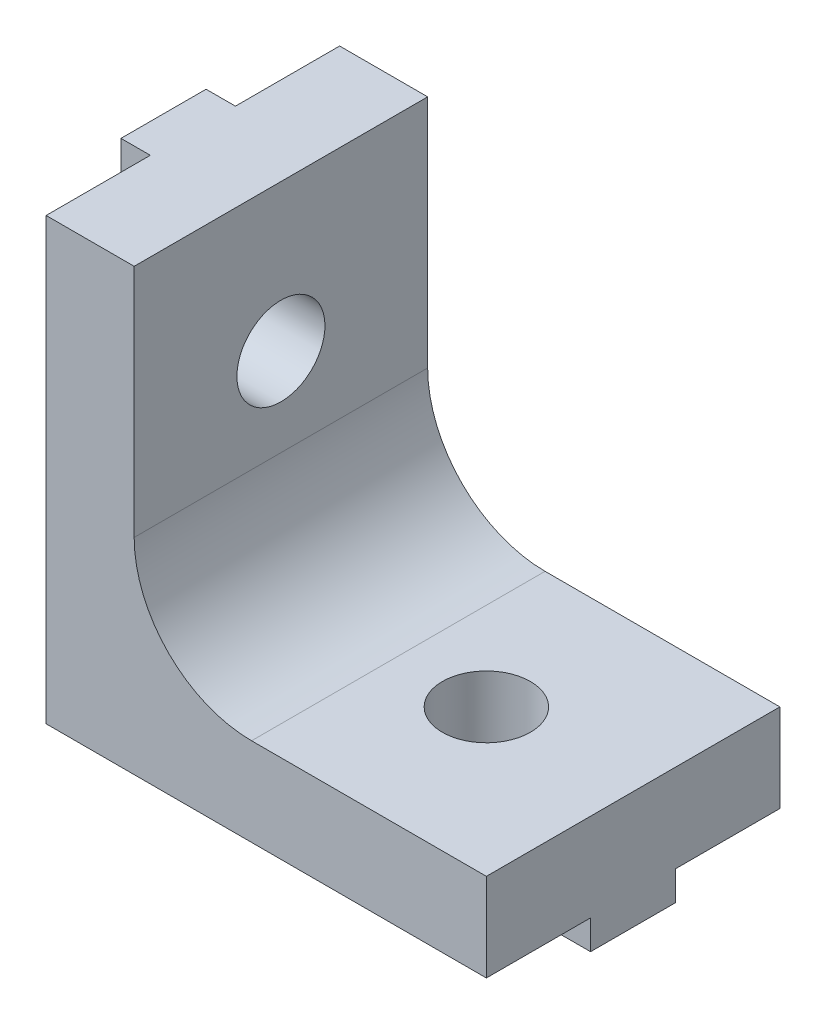
ISO-10303-21;
HEADER;
FILE_DESCRIPTION(('STEP AP214'),'2;1');
FILE_NAME('part.step','',(''),(''),'','','');
FILE_SCHEMA(('AUTOMOTIVE_DESIGN { 1 0 10303 214 1 1 1 1 }'));
ENDSEC;
DATA;
#1=APPLICATION_CONTEXT('core data for automotive mechanical design processes');
#2=APPLICATION_PROTOCOL_DEFINITION('international standard','automotive_design',2000,#1);
#3=PRODUCT_CONTEXT('',#1,'mechanical');
#4=PRODUCT('Part','Part','',(#3));
#5=PRODUCT_RELATED_PRODUCT_CATEGORY('part','',(#4));
#6=PRODUCT_DEFINITION_FORMATION('','',#4);
#7=PRODUCT_DEFINITION_CONTEXT('part definition',#1,'design');
#8=PRODUCT_DEFINITION('design','',#6,#7);
#9=PRODUCT_DEFINITION_SHAPE('','',#8);
#10=(LENGTH_UNIT() NAMED_UNIT(*) SI_UNIT(.MILLI.,.METRE.));
#11=(NAMED_UNIT(*) PLANE_ANGLE_UNIT() SI_UNIT($,.RADIAN.));
#12=(NAMED_UNIT(*) SI_UNIT($,.STERADIAN.) SOLID_ANGLE_UNIT());
#13=UNCERTAINTY_MEASURE_WITH_UNIT(LENGTH_MEASURE(1.E-05),#10,'distance_accuracy_value','');
#14=(GEOMETRIC_REPRESENTATION_CONTEXT(3) GLOBAL_UNCERTAINTY_ASSIGNED_CONTEXT((#13)) GLOBAL_UNIT_ASSIGNED_CONTEXT((#10,
#11,#12)) REPRESENTATION_CONTEXT('',''));
#15=CARTESIAN_POINT('',(0.,0.,0.));
#16=DIRECTION('',(0.,0.,1.));
#17=DIRECTION('',(1.,0.,0.));
#18=AXIS2_PLACEMENT_3D('',#15,#16,#17);
#19=CARTESIAN_POINT('',(0.,-1.,3.55));
#20=DIRECTION('',(0.,0.,1.));
#21=DIRECTION('',(1.,0.,0.));
#22=AXIS2_PLACEMENT_3D('',#19,#20,#21);
#23=PLANE('',#22);
#24=DIRECTION('',(1.,0.,0.));
#25=VECTOR('',#24,1.);
#26=CARTESIAN_POINT('',(0.,0.,3.55));
#27=LINE('',#26,#25);
#28=CARTESIAN_POINT('',(0.,0.,3.55));
#29=VERTEX_POINT('',#28);
#30=CARTESIAN_POINT('',(9.61594271260656,0.,3.55));
#31=VERTEX_POINT('',#30);
#32=EDGE_CURVE('E223',#29,#31,#27,.T.);
#33=ORIENTED_EDGE('',*,*,#32,.T.);
#34=DIRECTION('',(0.,-1.,0.));
#35=VECTOR('',#34,1.);
#36=CARTESIAN_POINT('',(9.61594271260656,15.,3.55));
#37=LINE('',#36,#35);
#38=CARTESIAN_POINT('',(9.61594271260656,-1.,3.55));
#39=VERTEX_POINT('',#38);
#40=EDGE_CURVE('E412',#31,#39,#37,.T.);
#41=ORIENTED_EDGE('',*,*,#40,.T.);
#42=DIRECTION('',(1.,0.,0.));
#43=VECTOR('',#42,1.);
#44=CARTESIAN_POINT('',(0.,-1.,3.55));
#45=LINE('',#44,#43);
#46=CARTESIAN_POINT('',(0.,-1.,3.55));
#47=VERTEX_POINT('',#46);
#48=EDGE_CURVE('E205',#47,#39,#45,.T.);
#49=ORIENTED_EDGE('',*,*,#48,.F.);
#50=DIRECTION('',(0.,1.,0.));
#51=VECTOR('',#50,1.);
#52=CARTESIAN_POINT('',(0.,-1.,3.55));
#53=LINE('',#52,#51);
#54=EDGE_CURVE('E234',#47,#29,#53,.T.);
#55=ORIENTED_EDGE('',*,*,#54,.T.);
#56=EDGE_LOOP('',(#33,#41,#49,#55));
#57=FACE_BOUND('',#56,.T.);
#58=ADVANCED_FACE('F32',(#57),#23,.F.);
#59=CARTESIAN_POINT('',(0.,-1.,6.45));
#60=DIRECTION('',(0.,0.,-1.));
#61=DIRECTION('',(-1.,0.,0.));
#62=AXIS2_PLACEMENT_3D('',#59,#60,#61);
#63=PLANE('',#62);
#64=DIRECTION('',(-1.,0.,0.));
#65=VECTOR('',#64,1.);
#66=CARTESIAN_POINT('',(0.,0.,6.45));
#67=LINE('',#66,#65);
#68=CARTESIAN_POINT('',(15.,0.,6.45));
#69=VERTEX_POINT('',#68);
#70=CARTESIAN_POINT('',(10.3840572873934,0.,6.45));
#71=VERTEX_POINT('',#70);
#72=EDGE_CURVE('E54',#69,#71,#67,.T.);
#73=ORIENTED_EDGE('',*,*,#72,.T.);
#74=DIRECTION('',(0.,-1.,0.));
#75=VECTOR('',#74,1.);
#76=CARTESIAN_POINT('',(10.3840572873934,15.,6.45));
#77=LINE('',#76,#75);
#78=CARTESIAN_POINT('',(10.3840572873934,-1.,6.45));
#79=VERTEX_POINT('',#78);
#80=EDGE_CURVE('E191',#71,#79,#77,.T.);
#81=ORIENTED_EDGE('',*,*,#80,.T.);
#82=DIRECTION('',(-1.,0.,0.));
#83=VECTOR('',#82,1.);
#84=CARTESIAN_POINT('',(0.,-1.,6.45));
#85=LINE('',#84,#83);
#86=CARTESIAN_POINT('',(15.,-1.,6.45));
#87=VERTEX_POINT('',#86);
#88=EDGE_CURVE('E199',#87,#79,#85,.T.);
#89=ORIENTED_EDGE('',*,*,#88,.F.);
#90=DIRECTION('',(0.,1.,0.));
#91=VECTOR('',#90,1.);
#92=CARTESIAN_POINT('',(15.,-1.,6.45));
#93=LINE('',#92,#91);
#94=EDGE_CURVE('E230',#87,#69,#93,.T.);
#95=ORIENTED_EDGE('',*,*,#94,.T.);
#96=EDGE_LOOP('',(#73,#81,#89,#95));
#97=FACE_BOUND('',#96,.T.);
#98=ADVANCED_FACE('F446',(#97),#63,.F.);
#99=CARTESIAN_POINT('',(0.,-1.,0.));
#100=DIRECTION('',(0.,1.,0.));
#101=DIRECTION('',(0.,0.,1.));
#102=AXIS2_PLACEMENT_3D('',#99,#100,#101);
#103=PLANE('',#102);
#104=ORIENTED_EDGE('',*,*,#88,.T.);
#105=CARTESIAN_POINT('',(10.,-1.,5.));
#106=DIRECTION('',(0.,-1.,0.));
#107=DIRECTION('',(0.,0.,-1.));
#108=AXIS2_PLACEMENT_3D('',#105,#106,#107);
#109=CIRCLE('',#108,1.5);
#110=CARTESIAN_POINT('',(10.3840572873934,-1.,3.55));
#111=VERTEX_POINT('',#110);
#112=EDGE_CURVE('E184',#111,#79,#109,.T.);
#113=ORIENTED_EDGE('',*,*,#112,.F.);
#114=CARTESIAN_POINT('',(15.,-1.,3.55));
#115=VERTEX_POINT('',#114);
#116=EDGE_CURVE('E196',#111,#115,#45,.T.);
#117=ORIENTED_EDGE('',*,*,#116,.T.);
#118=DIRECTION('',(0.,0.,1.));
#119=VECTOR('',#118,1.);
#120=CARTESIAN_POINT('',(15.,-1.,3.55));
#121=LINE('',#120,#119);
#122=EDGE_CURVE('E209',#115,#87,#121,.T.);
#123=ORIENTED_EDGE('',*,*,#122,.T.);
#124=EDGE_LOOP('',(#104,#113,#117,#123));
#125=FACE_BOUND('',#124,.T.);
#126=ADVANCED_FACE('F195',(#125),#103,.F.);
#127=CARTESIAN_POINT('',(0.,0.,10.));
#128=DIRECTION('',(0.,1.,0.));
#129=DIRECTION('',(0.,0.,1.));
#130=AXIS2_PLACEMENT_3D('',#127,#128,#129);
#131=PLANE('',#130);
#132=CARTESIAN_POINT('',(9.61594271260657,0.,6.45));
#133=VERTEX_POINT('',#132);
#134=CARTESIAN_POINT('',(0.,0.,6.45));
#135=VERTEX_POINT('',#134);
#136=EDGE_CURVE('E226',#133,#135,#67,.T.);
#137=ORIENTED_EDGE('',*,*,#136,.F.);
#138=CARTESIAN_POINT('',(10.,0.,5.));
#139=DIRECTION('',(0.,1.,0.));
#140=DIRECTION('',(0.,0.,1.));
#141=AXIS2_PLACEMENT_3D('',#138,#139,#140);
#142=CIRCLE('',#141,1.5);
#143=EDGE_CURVE('E423',#133,#71,#142,.T.);
#144=ORIENTED_EDGE('',*,*,#143,.T.);
#145=ORIENTED_EDGE('',*,*,#72,.F.);
#146=DIRECTION('',(0.,0.,-1.));
#147=VECTOR('',#146,1.);
#148=CARTESIAN_POINT('',(15.,0.,10.));
#149=LINE('',#148,#147);
#150=CARTESIAN_POINT('',(15.,0.,10.));
#151=VERTEX_POINT('',#150);
#152=EDGE_CURVE('E339',#151,#69,#149,.T.);
#153=ORIENTED_EDGE('',*,*,#152,.F.);
#154=DIRECTION('',(1.,0.,0.));
#155=VECTOR('',#154,1.);
#156=CARTESIAN_POINT('',(0.,0.,10.));
#157=LINE('',#156,#155);
#158=CARTESIAN_POINT('',(0.,0.,10.));
#159=VERTEX_POINT('',#158);
#160=EDGE_CURVE('E294',#159,#151,#157,.T.);
#161=ORIENTED_EDGE('',*,*,#160,.F.);
#162=DIRECTION('',(0.,0.,-1.));
#163=VECTOR('',#162,1.);
#164=CARTESIAN_POINT('',(0.,0.,10.));
#165=LINE('',#164,#163);
#166=EDGE_CURVE('E342',#159,#135,#165,.T.);
#167=ORIENTED_EDGE('',*,*,#166,.T.);
#168=EDGE_LOOP('',(#137,#144,#145,#153,#161,#167));
#169=FACE_BOUND('',#168,.T.);
#170=ADVANCED_FACE('F422',(#169),#131,.F.);
#171=DIRECTION('',(0.,0.,-1.));
#172=VECTOR('',#171,1.);
#173=CARTESIAN_POINT('',(0.,0.,3.55));
#174=LINE('',#173,#172);
#175=EDGE_CURVE('E218',#135,#29,#174,.T.);
#176=ORIENTED_EDGE('',*,*,#175,.F.);
#177=DIRECTION('',(1.,0.,0.));
#178=VECTOR('',#177,1.);
#179=CARTESIAN_POINT('',(-1.,0.,6.45000000000001));
#180=LINE('',#179,#178);
#181=CARTESIAN_POINT('',(-1.,0.,6.45000000000001));
#182=VERTEX_POINT('',#181);
#183=EDGE_CURVE('E284',#182,#135,#180,.T.);
#184=ORIENTED_EDGE('',*,*,#183,.F.);
#185=DIRECTION('',(0.,0.,1.));
#186=VECTOR('',#185,1.);
#187=CARTESIAN_POINT('',(-1.,0.,3.55));
#188=LINE('',#187,#186);
#189=CARTESIAN_POINT('',(-1.,0.,3.55));
#190=VERTEX_POINT('',#189);
#191=EDGE_CURVE('E262',#190,#182,#188,.T.);
#192=ORIENTED_EDGE('',*,*,#191,.F.);
#193=DIRECTION('',(1.,0.,0.));
#194=VECTOR('',#193,1.);
#195=CARTESIAN_POINT('',(-1.,0.,3.55));
#196=LINE('',#195,#194);
#197=EDGE_CURVE('E287',#190,#29,#196,.T.);
#198=ORIENTED_EDGE('',*,*,#197,.T.);
#199=EDGE_LOOP('',(#176,#184,#192,#198));
#200=FACE_BOUND('',#199,.T.);
#201=ADVANCED_FACE('F378',(#200),#131,.F.);
#202=CARTESIAN_POINT('',(10.3840572873934,0.,3.55));
#203=VERTEX_POINT('',#202);
#204=CARTESIAN_POINT('',(15.,0.,3.55));
#205=VERTEX_POINT('',#204);
#206=EDGE_CURVE('E221',#203,#205,#27,.T.);
#207=ORIENTED_EDGE('',*,*,#206,.F.);
#208=CARTESIAN_POINT('',(10.,0.,5.));
#209=DIRECTION('',(0.,1.,0.));
#210=DIRECTION('',(0.,0.,1.));
#211=AXIS2_PLACEMENT_3D('',#208,#209,#210);
#212=CIRCLE('',#211,1.5);
#213=EDGE_CURVE('E187',#203,#31,#212,.T.);
#214=ORIENTED_EDGE('',*,*,#213,.T.);
#215=ORIENTED_EDGE('',*,*,#32,.F.);
#216=CARTESIAN_POINT('',(0.,0.,0.));
#217=VERTEX_POINT('',#216);
#218=EDGE_CURVE('E341',#29,#217,#165,.T.);
#219=ORIENTED_EDGE('',*,*,#218,.T.);
#220=DIRECTION('',(1.,0.,0.));
#221=VECTOR('',#220,1.);
#222=CARTESIAN_POINT('',(0.,0.,0.));
#223=LINE('',#222,#221);
#224=CARTESIAN_POINT('',(15.,0.,0.));
#225=VERTEX_POINT('',#224);
#226=EDGE_CURVE('E310',#217,#225,#223,.T.);
#227=ORIENTED_EDGE('',*,*,#226,.T.);
#228=EDGE_CURVE('E338',#205,#225,#149,.T.);
#229=ORIENTED_EDGE('',*,*,#228,.F.);
#230=EDGE_LOOP('',(#207,#214,#215,#219,#227,#229));
#231=FACE_BOUND('',#230,.T.);
#232=ADVANCED_FACE('F409',(#231),#131,.F.);
#233=CARTESIAN_POINT('',(-1.,15.,3.55));
#234=DIRECTION('',(0.,0.,1.));
#235=DIRECTION('',(0.,-1.,0.));
#236=AXIS2_PLACEMENT_3D('',#233,#234,#235);
#237=PLANE('',#236);
#238=DIRECTION('',(0.,-1.,0.));
#239=VECTOR('',#238,1.);
#240=CARTESIAN_POINT('',(0.,15.,3.55));
#241=LINE('',#240,#239);
#242=CARTESIAN_POINT('',(0.,15.,3.55));
#243=VERTEX_POINT('',#242);
#244=CARTESIAN_POINT('',(0.,10.3840572873934,3.55));
#245=VERTEX_POINT('',#244);
#246=EDGE_CURVE('E272',#243,#245,#241,.T.);
#247=ORIENTED_EDGE('',*,*,#246,.T.);
#248=DIRECTION('',(-1.,0.,0.));
#249=VECTOR('',#248,1.);
#250=CARTESIAN_POINT('',(15.,10.3840572873934,3.55));
#251=LINE('',#250,#249);
#252=CARTESIAN_POINT('',(-1.,10.3840572873934,3.55));
#253=VERTEX_POINT('',#252);
#254=EDGE_CURVE('E252',#245,#253,#251,.T.);
#255=ORIENTED_EDGE('',*,*,#254,.T.);
#256=DIRECTION('',(0.,-1.,0.));
#257=VECTOR('',#256,1.);
#258=CARTESIAN_POINT('',(-1.,15.,3.55));
#259=LINE('',#258,#257);
#260=CARTESIAN_POINT('',(-1.,15.,3.55));
#261=VERTEX_POINT('',#260);
#262=EDGE_CURVE('E259',#261,#253,#259,.T.);
#263=ORIENTED_EDGE('',*,*,#262,.F.);
#264=DIRECTION('',(1.,0.,0.));
#265=VECTOR('',#264,1.);
#266=CARTESIAN_POINT('',(-1.,15.,3.55));
#267=LINE('',#266,#265);
#268=EDGE_CURVE('E271',#261,#243,#267,.T.);
#269=ORIENTED_EDGE('',*,*,#268,.T.);
#270=EDGE_LOOP('',(#247,#255,#263,#269));
#271=FACE_BOUND('',#270,.T.);
#272=ADVANCED_FACE('F354',(#271),#237,.F.);
#273=CARTESIAN_POINT('',(-1.,15.,6.45));
#274=DIRECTION('',(0.,0.,-1.));
#275=DIRECTION('',(0.,1.,0.));
#276=AXIS2_PLACEMENT_3D('',#273,#274,#275);
#277=PLANE('',#276);
#278=DIRECTION('',(0.,1.,0.));
#279=VECTOR('',#278,1.);
#280=CARTESIAN_POINT('',(0.,15.,6.45));
#281=LINE('',#280,#279);
#282=CARTESIAN_POINT('',(0.,9.61594271260656,6.45));
#283=VERTEX_POINT('',#282);
#284=EDGE_CURVE('E276',#135,#283,#281,.T.);
#285=ORIENTED_EDGE('',*,*,#284,.T.);
#286=DIRECTION('',(-1.,0.,0.));
#287=VECTOR('',#286,1.);
#288=CARTESIAN_POINT('',(15.,9.61594271260655,6.45));
#289=LINE('',#288,#287);
#290=CARTESIAN_POINT('',(-1.,9.61594271260656,6.45));
#291=VERTEX_POINT('',#290);
#292=EDGE_CURVE('E243',#283,#291,#289,.T.);
#293=ORIENTED_EDGE('',*,*,#292,.T.);
#294=DIRECTION('',(0.,1.,0.));
#295=VECTOR('',#294,1.);
#296=CARTESIAN_POINT('',(-1.,15.,6.45));
#297=LINE('',#296,#295);
#298=EDGE_CURVE('E266',#182,#291,#297,.T.);
#299=ORIENTED_EDGE('',*,*,#298,.F.);
#300=ORIENTED_EDGE('',*,*,#183,.T.);
#301=EDGE_LOOP('',(#285,#293,#299,#300));
#302=FACE_BOUND('',#301,.T.);
#303=ADVANCED_FACE('F382',(#302),#277,.F.);
#304=CARTESIAN_POINT('',(-1.,0.,0.));
#305=DIRECTION('',(-1.,0.,0.));
#306=DIRECTION('',(0.,-1.,0.));
#307=AXIS2_PLACEMENT_3D('',#304,#305,#306);
#308=PLANE('',#307);
#309=CARTESIAN_POINT('',(-0.999999999999999,10.,5.));
#310=DIRECTION('',(-1.,0.,0.));
#311=DIRECTION('',(0.,-1.,0.));
#312=AXIS2_PLACEMENT_3D('',#309,#310,#311);
#313=CIRCLE('',#312,1.5);
#314=CARTESIAN_POINT('',(-1.,10.3840572873934,6.45));
#315=VERTEX_POINT('',#314);
#316=EDGE_CURVE('E40',#315,#253,#313,.T.);
#317=ORIENTED_EDGE('',*,*,#316,.F.);
#318=CARTESIAN_POINT('',(-1.,15.,6.45));
#319=VERTEX_POINT('',#318);
#320=EDGE_CURVE('E265',#315,#319,#297,.T.);
#321=ORIENTED_EDGE('',*,*,#320,.T.);
#322=DIRECTION('',(0.,0.,-1.));
#323=VECTOR('',#322,1.);
#324=CARTESIAN_POINT('',(-1.,15.,3.55));
#325=LINE('',#324,#323);
#326=EDGE_CURVE('E269',#319,#261,#325,.T.);
#327=ORIENTED_EDGE('',*,*,#326,.T.);
#328=ORIENTED_EDGE('',*,*,#262,.T.);
#329=EDGE_LOOP('',(#317,#321,#327,#328));
#330=FACE_BOUND('',#329,.T.);
#331=ADVANCED_FACE('F355',(#330),#308,.T.);
#332=CARTESIAN_POINT('',(0.,15.,10.));
#333=DIRECTION('',(1.,0.,0.));
#334=DIRECTION('',(0.,1.,0.));
#335=AXIS2_PLACEMENT_3D('',#332,#333,#334);
#336=PLANE('',#335);
#337=CARTESIAN_POINT('',(0.,9.61594271260656,3.55));
#338=VERTEX_POINT('',#337);
#339=EDGE_CURVE('E258',#338,#29,#241,.T.);
#340=ORIENTED_EDGE('',*,*,#339,.F.);
#341=CARTESIAN_POINT('',(0.,10.,5.));
#342=DIRECTION('',(1.,0.,0.));
#343=DIRECTION('',(0.,1.,0.));
#344=AXIS2_PLACEMENT_3D('',#341,#342,#343);
#345=CIRCLE('',#344,1.5);
#346=EDGE_CURVE('E249',#338,#245,#345,.T.);
#347=ORIENTED_EDGE('',*,*,#346,.T.);
#348=ORIENTED_EDGE('',*,*,#246,.F.);
#349=DIRECTION('',(0.,0.,-1.));
#350=VECTOR('',#349,1.);
#351=CARTESIAN_POINT('',(0.,15.,10.));
#352=LINE('',#351,#350);
#353=CARTESIAN_POINT('',(0.,15.,0.));
#354=VERTEX_POINT('',#353);
#355=EDGE_CURVE('E307',#243,#354,#352,.T.);
#356=ORIENTED_EDGE('',*,*,#355,.T.);
#357=DIRECTION('',(0.,-1.,0.));
#358=VECTOR('',#357,1.);
#359=CARTESIAN_POINT('',(0.,15.,0.));
#360=LINE('',#359,#358);
#361=EDGE_CURVE('E290',#354,#217,#360,.T.);
#362=ORIENTED_EDGE('',*,*,#361,.T.);
#363=ORIENTED_EDGE('',*,*,#218,.F.);
#364=EDGE_LOOP('',(#340,#347,#348,#356,#362,#363));
#365=FACE_BOUND('',#364,.T.);
#366=ADVANCED_FACE('F34',(#365),#336,.F.);
#367=CARTESIAN_POINT('',(0.,10.3840572873934,6.45));
#368=VERTEX_POINT('',#367);
#369=CARTESIAN_POINT('',(0.,15.,6.45));
#370=VERTEX_POINT('',#369);
#371=EDGE_CURVE('E275',#368,#370,#281,.T.);
#372=ORIENTED_EDGE('',*,*,#371,.F.);
#373=CARTESIAN_POINT('',(0.,10.,5.));
#374=DIRECTION('',(1.,0.,0.));
#375=DIRECTION('',(0.,1.,0.));
#376=AXIS2_PLACEMENT_3D('',#373,#374,#375);
#377=CIRCLE('',#376,1.5);
#378=EDGE_CURVE('E240',#368,#283,#377,.T.);
#379=ORIENTED_EDGE('',*,*,#378,.T.);
#380=ORIENTED_EDGE('',*,*,#284,.F.);
#381=ORIENTED_EDGE('',*,*,#166,.F.);
#382=DIRECTION('',(0.,-1.,0.));
#383=VECTOR('',#382,1.);
#384=CARTESIAN_POINT('',(0.,15.,10.));
#385=LINE('',#384,#383);
#386=CARTESIAN_POINT('',(0.,15.,10.));
#387=VERTEX_POINT('',#386);
#388=EDGE_CURVE('E291',#387,#159,#385,.T.);
#389=ORIENTED_EDGE('',*,*,#388,.F.);
#390=EDGE_CURVE('E323',#387,#370,#352,.T.);
#391=ORIENTED_EDGE('',*,*,#390,.T.);
#392=EDGE_LOOP('',(#372,#379,#380,#381,#389,#391));
#393=FACE_BOUND('',#392,.T.);
#394=ADVANCED_FACE('F385',(#393),#336,.F.);
#395=CARTESIAN_POINT('',(15.,0.,10.));
#396=DIRECTION('',(-1.,0.,0.));
#397=DIRECTION('',(0.,0.,1.));
#398=AXIS2_PLACEMENT_3D('',#395,#396,#397);
#399=PLANE('',#398);
#400=DIRECTION('',(0.,1.,0.));
#401=VECTOR('',#400,1.);
#402=CARTESIAN_POINT('',(15.,0.,0.));
#403=LINE('',#402,#401);
#404=CARTESIAN_POINT('',(15.,3.,0.));
#405=VERTEX_POINT('',#404);
#406=EDGE_CURVE('E313',#225,#405,#403,.T.);
#407=ORIENTED_EDGE('',*,*,#406,.T.);
#408=DIRECTION('',(0.,0.,-1.));
#409=VECTOR('',#408,1.);
#410=CARTESIAN_POINT('',(15.,3.,10.));
#411=LINE('',#410,#409);
#412=CARTESIAN_POINT('',(15.,3.,10.));
#413=VERTEX_POINT('',#412);
#414=EDGE_CURVE('E335',#413,#405,#411,.T.);
#415=ORIENTED_EDGE('',*,*,#414,.F.);
#416=DIRECTION('',(0.,1.,0.));
#417=VECTOR('',#416,1.);
#418=CARTESIAN_POINT('',(15.,0.,10.));
#419=LINE('',#418,#417);
#420=EDGE_CURVE('E297',#151,#413,#419,.T.);
#421=ORIENTED_EDGE('',*,*,#420,.F.);
#422=ORIENTED_EDGE('',*,*,#152,.T.);
#423=ORIENTED_EDGE('',*,*,#94,.F.);
#424=ORIENTED_EDGE('',*,*,#122,.F.);
#425=DIRECTION('',(0.,1.,0.));
#426=VECTOR('',#425,1.);
#427=CARTESIAN_POINT('',(15.,-1.,3.55));
#428=LINE('',#427,#426);
#429=EDGE_CURVE('E203',#115,#205,#428,.T.);
#430=ORIENTED_EDGE('',*,*,#429,.T.);
#431=ORIENTED_EDGE('',*,*,#228,.T.);
#432=EDGE_LOOP('',(#407,#415,#421,#422,#423,#424,#430,#431));
#433=FACE_BOUND('',#432,.T.);
#434=ADVANCED_FACE('F428',(#433),#399,.F.);
#435=CARTESIAN_POINT('',(15.,3.,10.));
#436=DIRECTION('',(0.,-1.,0.));
#437=DIRECTION('',(1.,0.,0.));
#438=AXIS2_PLACEMENT_3D('',#435,#436,#437);
#439=PLANE('',#438);
#440=CARTESIAN_POINT('',(10.,3.,5.));
#441=DIRECTION('',(0.,-1.,0.));
#442=DIRECTION('',(1.,0.,0.));
#443=AXIS2_PLACEMENT_3D('',#440,#441,#442);
#444=CIRCLE('',#443,1.5);
#445=CARTESIAN_POINT('',(11.5,3.,5.));
#446=VERTEX_POINT('',#445);
#447=EDGE_CURVE('E222',#446,#446,#444,.T.);
#448=ORIENTED_EDGE('',*,*,#447,.T.);
#449=EDGE_LOOP('',(#448));
#450=FACE_BOUND('',#449,.T.);
#451=DIRECTION('',(-1.,0.,0.));
#452=VECTOR('',#451,1.);
#453=CARTESIAN_POINT('',(15.,3.,0.));
#454=LINE('',#453,#452);
#455=CARTESIAN_POINT('',(7.,3.,0.));
#456=VERTEX_POINT('',#455);
#457=EDGE_CURVE('E315',#405,#456,#454,.T.);
#458=ORIENTED_EDGE('',*,*,#457,.T.);
#459=DIRECTION('',(0.,0.,-1.));
#460=VECTOR('',#459,1.);
#461=CARTESIAN_POINT('',(7.,3.,10.));
#462=LINE('',#461,#460);
#463=CARTESIAN_POINT('',(7.,3.,10.));
#464=VERTEX_POINT('',#463);
#465=EDGE_CURVE('E332',#464,#456,#462,.T.);
#466=ORIENTED_EDGE('',*,*,#465,.F.);
#467=DIRECTION('',(-1.,0.,0.));
#468=VECTOR('',#467,1.);
#469=CARTESIAN_POINT('',(15.,3.,10.));
#470=LINE('',#469,#468);
#471=EDGE_CURVE('E299',#413,#464,#470,.T.);
#472=ORIENTED_EDGE('',*,*,#471,.F.);
#473=ORIENTED_EDGE('',*,*,#414,.T.);
#474=EDGE_LOOP('',(#458,#466,#472,#473));
#475=FACE_BOUND('',#474,.T.);
#476=ADVANCED_FACE('F432',(#450,#475),#439,.F.);
#477=CARTESIAN_POINT('',(7.,7.,10.));
#478=DIRECTION('',(0.,0.,-1.));
#479=DIRECTION('',(-1.,0.,0.));
#480=AXIS2_PLACEMENT_3D('',#477,#478,#479);
#481=CYLINDRICAL_SURFACE('',#480,4.);
#482=CARTESIAN_POINT('',(7.,7.,0.));
#483=DIRECTION('',(0.,0.,-1.));
#484=DIRECTION('',(-1.,0.,0.));
#485=AXIS2_PLACEMENT_3D('',#482,#483,#484);
#486=CIRCLE('',#485,4.);
#487=CARTESIAN_POINT('',(3.,7.,0.));
#488=VERTEX_POINT('',#487);
#489=EDGE_CURVE('E317',#456,#488,#486,.T.);
#490=ORIENTED_EDGE('',*,*,#489,.T.);
#491=DIRECTION('',(0.,0.,-1.));
#492=VECTOR('',#491,1.);
#493=CARTESIAN_POINT('',(3.,7.,10.));
#494=LINE('',#493,#492);
#495=CARTESIAN_POINT('',(3.,7.,10.));
#496=VERTEX_POINT('',#495);
#497=EDGE_CURVE('E329',#496,#488,#494,.T.);
#498=ORIENTED_EDGE('',*,*,#497,.F.);
#499=CARTESIAN_POINT('',(7.,7.,10.));
#500=DIRECTION('',(0.,0.,-1.));
#501=DIRECTION('',(-1.,0.,0.));
#502=AXIS2_PLACEMENT_3D('',#499,#500,#501);
#503=CIRCLE('',#502,4.);
#504=EDGE_CURVE('E301',#464,#496,#503,.T.);
#505=ORIENTED_EDGE('',*,*,#504,.F.);
#506=ORIENTED_EDGE('',*,*,#465,.T.);
#507=EDGE_LOOP('',(#490,#498,#505,#506));
#508=FACE_BOUND('',#507,.T.);
#509=ADVANCED_FACE('F434',(#508),#481,.F.);
#510=CARTESIAN_POINT('',(3.,7.,10.));
#511=DIRECTION('',(-1.,0.,0.));
#512=DIRECTION('',(0.,-1.,0.));
#513=AXIS2_PLACEMENT_3D('',#510,#511,#512);
#514=PLANE('',#513);
#515=CARTESIAN_POINT('',(3.,10.,5.));
#516=DIRECTION('',(-1.,0.,0.));
#517=DIRECTION('',(0.,-1.,0.));
#518=AXIS2_PLACEMENT_3D('',#515,#516,#517);
#519=CIRCLE('',#518,1.5);
#520=CARTESIAN_POINT('',(3.,8.49999999999999,5.));
#521=VERTEX_POINT('',#520);
#522=EDGE_CURVE('E255',#521,#521,#519,.T.);
#523=ORIENTED_EDGE('',*,*,#522,.T.);
#524=EDGE_LOOP('',(#523));
#525=FACE_BOUND('',#524,.T.);
#526=DIRECTION('',(0.,1.,0.));
#527=VECTOR('',#526,1.);
#528=CARTESIAN_POINT('',(3.,7.,0.));
#529=LINE('',#528,#527);
#530=CARTESIAN_POINT('',(3.,15.,0.));
#531=VERTEX_POINT('',#530);
#532=EDGE_CURVE('E319',#488,#531,#529,.T.);
#533=ORIENTED_EDGE('',*,*,#532,.T.);
#534=DIRECTION('',(0.,0.,-1.));
#535=VECTOR('',#534,1.);
#536=CARTESIAN_POINT('',(3.,15.,10.));
#537=LINE('',#536,#535);
#538=CARTESIAN_POINT('',(3.,15.,10.));
#539=VERTEX_POINT('',#538);
#540=EDGE_CURVE('E326',#539,#531,#537,.T.);
#541=ORIENTED_EDGE('',*,*,#540,.F.);
#542=DIRECTION('',(0.,1.,0.));
#543=VECTOR('',#542,1.);
#544=CARTESIAN_POINT('',(3.,7.,10.));
#545=LINE('',#544,#543);
#546=EDGE_CURVE('E303',#496,#539,#545,.T.);
#547=ORIENTED_EDGE('',*,*,#546,.F.);
#548=ORIENTED_EDGE('',*,*,#497,.T.);
#549=EDGE_LOOP('',(#533,#541,#547,#548));
#550=FACE_BOUND('',#549,.T.);
#551=ADVANCED_FACE('F399',(#525,#550),#514,.F.);
#552=CARTESIAN_POINT('',(3.,15.,10.));
#553=DIRECTION('',(0.,-1.,0.));
#554=DIRECTION('',(0.,0.,-1.));
#555=AXIS2_PLACEMENT_3D('',#552,#553,#554);
#556=PLANE('',#555);
#557=DIRECTION('',(-1.,0.,0.));
#558=VECTOR('',#557,1.);
#559=CARTESIAN_POINT('',(3.,15.,0.));
#560=LINE('',#559,#558);
#561=EDGE_CURVE('E295',#531,#354,#560,.T.);
#562=ORIENTED_EDGE('',*,*,#561,.T.);
#563=ORIENTED_EDGE('',*,*,#355,.F.);
#564=ORIENTED_EDGE('',*,*,#268,.F.);
#565=ORIENTED_EDGE('',*,*,#326,.F.);
#566=DIRECTION('',(1.,0.,0.));
#567=VECTOR('',#566,1.);
#568=CARTESIAN_POINT('',(-1.,15.,6.45));
#569=LINE('',#568,#567);
#570=EDGE_CURVE('E281',#319,#370,#569,.T.);
#571=ORIENTED_EDGE('',*,*,#570,.T.);
#572=ORIENTED_EDGE('',*,*,#390,.F.);
#573=DIRECTION('',(-1.,0.,0.));
#574=VECTOR('',#573,1.);
#575=CARTESIAN_POINT('',(3.,15.,10.));
#576=LINE('',#575,#574);
#577=EDGE_CURVE('E305',#539,#387,#576,.T.);
#578=ORIENTED_EDGE('',*,*,#577,.F.);
#579=ORIENTED_EDGE('',*,*,#540,.T.);
#580=EDGE_LOOP('',(#562,#563,#564,#565,#571,#572,#578,#579));
#581=FACE_BOUND('',#580,.T.);
#582=ADVANCED_FACE('F361',(#581),#556,.F.);
#583=CARTESIAN_POINT('',(7.,7.,10.));
#584=DIRECTION('',(0.,0.,-1.));
#585=DIRECTION('',(-1.,0.,0.));
#586=AXIS2_PLACEMENT_3D('',#583,#584,#585);
#587=PLANE('',#586);
#588=ORIENTED_EDGE('',*,*,#388,.T.);
#589=ORIENTED_EDGE('',*,*,#160,.T.);
#590=ORIENTED_EDGE('',*,*,#420,.T.);
#591=ORIENTED_EDGE('',*,*,#471,.T.);
#592=ORIENTED_EDGE('',*,*,#504,.T.);
#593=ORIENTED_EDGE('',*,*,#546,.T.);
#594=ORIENTED_EDGE('',*,*,#577,.T.);
#595=EDGE_LOOP('',(#588,#589,#590,#591,#592,#593,#594));
#596=FACE_BOUND('',#595,.T.);
#597=ADVANCED_FACE('F393',(#596),#587,.F.);
#598=CARTESIAN_POINT('',(7.,7.,0.));
#599=DIRECTION('',(0.,0.,-1.));
#600=DIRECTION('',(-1.,0.,0.));
#601=AXIS2_PLACEMENT_3D('',#598,#599,#600);
#602=PLANE('',#601);
#603=ORIENTED_EDGE('',*,*,#361,.F.);
#604=ORIENTED_EDGE('',*,*,#561,.F.);
#605=ORIENTED_EDGE('',*,*,#532,.F.);
#606=ORIENTED_EDGE('',*,*,#489,.F.);
#607=ORIENTED_EDGE('',*,*,#457,.F.);
#608=ORIENTED_EDGE('',*,*,#406,.F.);
#609=ORIENTED_EDGE('',*,*,#226,.F.);
#610=EDGE_LOOP('',(#603,#604,#605,#606,#607,#608,#609));
#611=FACE_BOUND('',#610,.T.);
#612=ADVANCED_FACE('F402',(#611),#602,.T.);
#613=CARTESIAN_POINT('',(-0.999999999999999,9.61594271260656,3.55));
#614=VERTEX_POINT('',#613);
#615=EDGE_CURVE('E263',#614,#190,#259,.T.);
#616=ORIENTED_EDGE('',*,*,#615,.F.);
#617=DIRECTION('',(-1.,0.,0.));
#618=VECTOR('',#617,1.);
#619=CARTESIAN_POINT('',(15.,9.61594271260655,3.55));
#620=LINE('',#619,#618);
#621=EDGE_CURVE('E246',#614,#338,#620,.F.);
#622=ORIENTED_EDGE('',*,*,#621,.T.);
#623=ORIENTED_EDGE('',*,*,#339,.T.);
#624=ORIENTED_EDGE('',*,*,#197,.F.);
#625=EDGE_LOOP('',(#616,#622,#623,#624));
#626=FACE_BOUND('',#625,.T.);
#627=ADVANCED_FACE('F370',(#626),#237,.F.);
#628=ORIENTED_EDGE('',*,*,#320,.F.);
#629=DIRECTION('',(-1.,0.,0.));
#630=VECTOR('',#629,1.);
#631=CARTESIAN_POINT('',(15.,10.3840572873934,6.45));
#632=LINE('',#631,#630);
#633=EDGE_CURVE('E237',#315,#368,#632,.F.);
#634=ORIENTED_EDGE('',*,*,#633,.T.);
#635=ORIENTED_EDGE('',*,*,#371,.T.);
#636=ORIENTED_EDGE('',*,*,#570,.F.);
#637=EDGE_LOOP('',(#628,#634,#635,#636));
#638=FACE_BOUND('',#637,.T.);
#639=ADVANCED_FACE('F390',(#638),#277,.F.);
#640=EDGE_CURVE('E344',#614,#291,#313,.T.);
#641=ORIENTED_EDGE('',*,*,#640,.F.);
#642=ORIENTED_EDGE('',*,*,#615,.T.);
#643=ORIENTED_EDGE('',*,*,#191,.T.);
#644=ORIENTED_EDGE('',*,*,#298,.T.);
#645=EDGE_LOOP('',(#641,#642,#643,#644));
#646=FACE_BOUND('',#645,.T.);
#647=ADVANCED_FACE('F374',(#646),#308,.T.);
#648=CARTESIAN_POINT('',(15.,9.99999999999999,5.));
#649=DIRECTION('',(-1.,0.,0.));
#650=DIRECTION('',(0.,-1.,0.));
#651=AXIS2_PLACEMENT_3D('',#648,#649,#650);
#652=CYLINDRICAL_SURFACE('',#651,1.5);
#653=ORIENTED_EDGE('',*,*,#346,.F.);
#654=ORIENTED_EDGE('',*,*,#621,.F.);
#655=ORIENTED_EDGE('',*,*,#640,.T.);
#656=ORIENTED_EDGE('',*,*,#292,.F.);
#657=ORIENTED_EDGE('',*,*,#378,.F.);
#658=ORIENTED_EDGE('',*,*,#633,.F.);
#659=ORIENTED_EDGE('',*,*,#316,.T.);
#660=ORIENTED_EDGE('',*,*,#254,.F.);
#661=EDGE_LOOP('',(#653,#654,#655,#656,#657,#658,#659,#660));
#662=FACE_BOUND('',#661,.T.);
#663=ORIENTED_EDGE('',*,*,#522,.F.);
#664=EDGE_LOOP('',(#663));
#665=FACE_BOUND('',#664,.T.);
#666=ADVANCED_FACE('F348',(#662,#665),#652,.F.);
#667=CARTESIAN_POINT('',(0.,-1.,3.55));
#668=DIRECTION('',(1.,0.,0.));
#669=DIRECTION('',(0.,0.,-1.));
#670=AXIS2_PLACEMENT_3D('',#667,#668,#669);
#671=PLANE('',#670);
#672=ORIENTED_EDGE('',*,*,#175,.T.);
#673=ORIENTED_EDGE('',*,*,#54,.F.);
#674=DIRECTION('',(0.,0.,-1.));
#675=VECTOR('',#674,1.);
#676=CARTESIAN_POINT('',(0.,-1.,3.55));
#677=LINE('',#676,#675);
#678=CARTESIAN_POINT('',(0.,-1.,6.45));
#679=VERTEX_POINT('',#678);
#680=EDGE_CURVE('E206',#679,#47,#677,.T.);
#681=ORIENTED_EDGE('',*,*,#680,.F.);
#682=DIRECTION('',(0.,1.,0.));
#683=VECTOR('',#682,1.);
#684=CARTESIAN_POINT('',(0.,-1.,6.45));
#685=LINE('',#684,#683);
#686=EDGE_CURVE('E217',#679,#135,#685,.T.);
#687=ORIENTED_EDGE('',*,*,#686,.T.);
#688=EDGE_LOOP('',(#672,#673,#681,#687));
#689=FACE_BOUND('',#688,.T.);
#690=ADVANCED_FACE('F416',(#689),#671,.F.);
#691=ORIENTED_EDGE('',*,*,#116,.F.);
#692=DIRECTION('',(0.,-1.,0.));
#693=VECTOR('',#692,1.);
#694=CARTESIAN_POINT('',(10.3840572873934,15.,3.55));
#695=LINE('',#694,#693);
#696=EDGE_CURVE('E180',#111,#203,#695,.F.);
#697=ORIENTED_EDGE('',*,*,#696,.T.);
#698=ORIENTED_EDGE('',*,*,#206,.T.);
#699=ORIENTED_EDGE('',*,*,#429,.F.);
#700=EDGE_LOOP('',(#691,#697,#698,#699));
#701=FACE_BOUND('',#700,.T.);
#702=ADVANCED_FACE('F201',(#701),#23,.F.);
#703=CARTESIAN_POINT('',(9.61594271260657,-0.999999999999999,6.45));
#704=VERTEX_POINT('',#703);
#705=EDGE_CURVE('E215',#704,#679,#85,.T.);
#706=ORIENTED_EDGE('',*,*,#705,.F.);
#707=DIRECTION('',(0.,-1.,0.));
#708=VECTOR('',#707,1.);
#709=CARTESIAN_POINT('',(9.61594271260657,15.,6.45));
#710=LINE('',#709,#708);
#711=EDGE_CURVE('E47',#704,#133,#710,.F.);
#712=ORIENTED_EDGE('',*,*,#711,.T.);
#713=ORIENTED_EDGE('',*,*,#136,.T.);
#714=ORIENTED_EDGE('',*,*,#686,.F.);
#715=EDGE_LOOP('',(#706,#712,#713,#714));
#716=FACE_BOUND('',#715,.T.);
#717=ADVANCED_FACE('F420',(#716),#63,.F.);
#718=ORIENTED_EDGE('',*,*,#48,.T.);
#719=CARTESIAN_POINT('',(10.,-0.999999999999999,5.));
#720=DIRECTION('',(0.,1.,0.));
#721=DIRECTION('',(0.,0.,1.));
#722=AXIS2_PLACEMENT_3D('',#719,#720,#721);
#723=CIRCLE('',#722,1.5);
#724=EDGE_CURVE('E11',#39,#704,#723,.T.);
#725=ORIENTED_EDGE('',*,*,#724,.T.);
#726=ORIENTED_EDGE('',*,*,#705,.T.);
#727=ORIENTED_EDGE('',*,*,#680,.T.);
#728=EDGE_LOOP('',(#718,#725,#726,#727));
#729=FACE_BOUND('',#728,.T.);
#730=ADVANCED_FACE('F459',(#729),#103,.F.);
#731=CARTESIAN_POINT('',(10.,15.,5.));
#732=DIRECTION('',(0.,-1.,0.));
#733=DIRECTION('',(0.,0.,-1.));
#734=AXIS2_PLACEMENT_3D('',#731,#732,#733);
#735=CYLINDRICAL_SURFACE('',#734,1.5);
#736=ORIENTED_EDGE('',*,*,#213,.F.);
#737=ORIENTED_EDGE('',*,*,#696,.F.);
#738=ORIENTED_EDGE('',*,*,#112,.T.);
#739=ORIENTED_EDGE('',*,*,#80,.F.);
#740=ORIENTED_EDGE('',*,*,#143,.F.);
#741=ORIENTED_EDGE('',*,*,#711,.F.);
#742=ORIENTED_EDGE('',*,*,#724,.F.);
#743=ORIENTED_EDGE('',*,*,#40,.F.);
#744=EDGE_LOOP('',(#736,#737,#738,#739,#740,#741,#742,#743));
#745=FACE_BOUND('',#744,.T.);
#746=ORIENTED_EDGE('',*,*,#447,.F.);
#747=EDGE_LOOP('',(#746));
#748=FACE_BOUND('',#747,.T.);
#749=ADVANCED_FACE('F182',(#745,#748),#735,.F.);
#750=CLOSED_SHELL('',(#58,#98,#126,#170,#201,#232,#272,#303,#331,#366,#394,#434,#476,#509,#551,
#582,#597,#612,#627,#639,#647,#666,#690,#702,#717,#730,#749));
#751=MANIFOLD_SOLID_BREP('B2',#750);
#752=ADVANCED_BREP_SHAPE_REPRESENTATION('',(#18,#751),#14);
#753=SHAPE_DEFINITION_REPRESENTATION(#9,#752);
ENDSEC;
END-ISO-10303-21;
